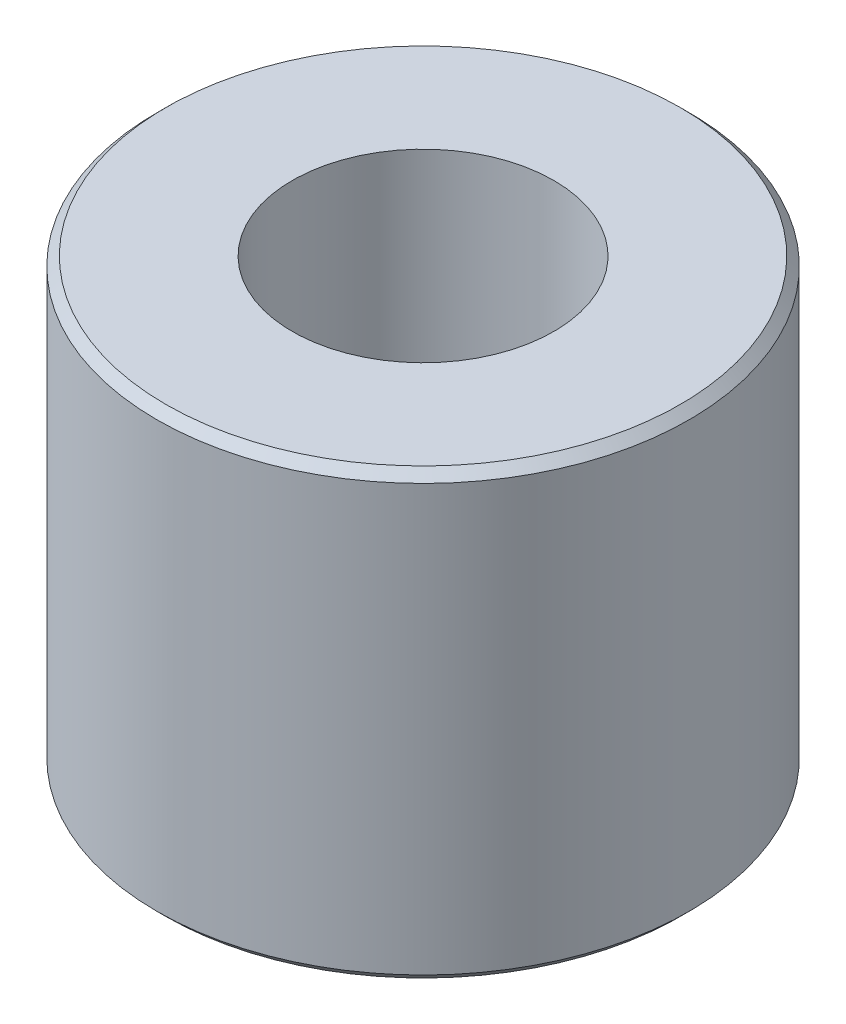
ISO-10303-21;
HEADER;
FILE_DESCRIPTION(('STEP AP214'),'2;1');
FILE_NAME('part.step','',(''),(''),'','','');
FILE_SCHEMA(('AUTOMOTIVE_DESIGN { 1 0 10303 214 1 1 1 1 }'));
ENDSEC;
DATA;
#1=APPLICATION_CONTEXT('core data for automotive mechanical design processes');
#2=APPLICATION_PROTOCOL_DEFINITION('international standard','automotive_design',2000,#1);
#3=PRODUCT_CONTEXT('',#1,'mechanical');
#4=PRODUCT('Part','Part','',(#3));
#5=PRODUCT_RELATED_PRODUCT_CATEGORY('part','',(#4));
#6=PRODUCT_DEFINITION_FORMATION('','',#4);
#7=PRODUCT_DEFINITION_CONTEXT('part definition',#1,'design');
#8=PRODUCT_DEFINITION('design','',#6,#7);
#9=PRODUCT_DEFINITION_SHAPE('','',#8);
#10=(LENGTH_UNIT() NAMED_UNIT(*) SI_UNIT(.MILLI.,.METRE.));
#11=(NAMED_UNIT(*) PLANE_ANGLE_UNIT() SI_UNIT($,.RADIAN.));
#12=(NAMED_UNIT(*) SI_UNIT($,.STERADIAN.) SOLID_ANGLE_UNIT());
#13=UNCERTAINTY_MEASURE_WITH_UNIT(LENGTH_MEASURE(1.E-05),#10,'distance_accuracy_value','');
#14=(GEOMETRIC_REPRESENTATION_CONTEXT(3) GLOBAL_UNCERTAINTY_ASSIGNED_CONTEXT((#13)) GLOBAL_UNIT_ASSIGNED_CONTEXT((#10,
#11,#12)) REPRESENTATION_CONTEXT('',''));
#15=CARTESIAN_POINT('',(0.,0.,0.));
#16=DIRECTION('',(0.,0.,1.));
#17=DIRECTION('',(1.,0.,0.));
#18=AXIS2_PLACEMENT_3D('',#15,#16,#17);
#19=CARTESIAN_POINT('',(0.,57.7500232056,0.));
#20=DIRECTION('',(0.,-1.,0.));
#21=DIRECTION('',(0.,0.,-1.));
#22=AXIS2_PLACEMENT_3D('',#19,#20,#21);
#23=CYLINDRICAL_SURFACE('',#22,14.75);
#24=CARTESIAN_POINT('',(0.,50.,0.));
#25=DIRECTION('',(0.,-1.,0.));
#26=DIRECTION('',(0.,0.,-1.));
#27=AXIS2_PLACEMENT_3D('',#24,#25,#26);
#28=CIRCLE('',#27,14.75);
#29=CARTESIAN_POINT('',(0.,50.,-14.75));
#30=VERTEX_POINT('',#29);
#31=EDGE_CURVE('P0_E33',#30,#30,#28,.T.);
#32=ORIENTED_EDGE('',*,*,#31,.F.);
#33=EDGE_LOOP('',(#32));
#34=FACE_BOUND('',#33,.T.);
#35=CARTESIAN_POINT('',(0.,0.,0.));
#36=DIRECTION('',(0.,-1.,0.));
#37=DIRECTION('',(0.,0.,-1.));
#38=AXIS2_PLACEMENT_3D('',#35,#36,#37);
#39=CIRCLE('',#38,14.75);
#40=CARTESIAN_POINT('',(0.,0.,-14.75));
#41=VERTEX_POINT('',#40);
#42=EDGE_CURVE('P0_E17',#41,#41,#39,.T.);
#43=ORIENTED_EDGE('',*,*,#42,.T.);
#44=EDGE_LOOP('',(#43));
#45=FACE_BOUND('',#44,.T.);
#46=ADVANCED_FACE('P0_F14',(#34,#45),#23,.F.);
#47=CARTESIAN_POINT('',(0.,0.,0.));
#48=DIRECTION('',(0.,1.,0.));
#49=DIRECTION('',(0.,0.,1.));
#50=AXIS2_PLACEMENT_3D('',#47,#48,#49);
#51=PLANE('',#50);
#52=ORIENTED_EDGE('',*,*,#42,.F.);
#53=EDGE_LOOP('',(#52));
#54=FACE_BOUND('',#53,.T.);
#55=CARTESIAN_POINT('',(0.,0.,0.));
#56=DIRECTION('',(0.,1.,0.));
#57=DIRECTION('',(0.,0.,1.));
#58=AXIS2_PLACEMENT_3D('',#55,#56,#57);
#59=CIRCLE('',#58,28.9999947346989);
#60=CARTESIAN_POINT('',(0.,0.,28.999994734699));
#61=VERTEX_POINT('',#60);
#62=EDGE_CURVE('P0_E31',#61,#61,#59,.T.);
#63=ORIENTED_EDGE('',*,*,#62,.F.);
#64=EDGE_LOOP('',(#63));
#65=FACE_BOUND('',#64,.T.);
#66=ADVANCED_FACE('P0_F41',(#54,#65),#51,.F.);
#67=CARTESIAN_POINT('',(0.,50.,0.));
#68=DIRECTION('',(0.,1.,0.));
#69=DIRECTION('',(0.,0.,1.));
#70=AXIS2_PLACEMENT_3D('',#67,#68,#69);
#71=PLANE('',#70);
#72=ORIENTED_EDGE('',*,*,#31,.T.);
#73=EDGE_LOOP('',(#72));
#74=FACE_BOUND('',#73,.T.);
#75=CARTESIAN_POINT('',(0.,50.,0.));
#76=DIRECTION('',(0.,1.,0.));
#77=DIRECTION('',(0.,0.,1.));
#78=AXIS2_PLACEMENT_3D('',#75,#76,#77);
#79=CIRCLE('',#78,28.9999947347188);
#80=CARTESIAN_POINT('',(0.,50.,28.9999947347188));
#81=VERTEX_POINT('',#80);
#82=EDGE_CURVE('P0_E26',#81,#81,#79,.F.);
#83=ORIENTED_EDGE('',*,*,#82,.F.);
#84=EDGE_LOOP('',(#83));
#85=FACE_BOUND('',#84,.T.);
#86=ADVANCED_FACE('P0_F44',(#74,#85),#71,.T.);
#87=CARTESIAN_POINT('',(0.,1.00000272317718,0.));
#88=DIRECTION('',(0.,1.,0.));
#89=DIRECTION('',(0.,0.,1.));
#90=AXIS2_PLACEMENT_3D('',#87,#88,#89);
#91=CONICAL_SURFACE('',#90,29.9999972763128,0.785398072616002);
#92=CARTESIAN_POINT('',(0.,1.,0.));
#93=DIRECTION('',(0.,1.,0.));
#94=DIRECTION('',(0.,0.,1.));
#95=AXIS2_PLACEMENT_3D('',#92,#93,#94);
#96=CIRCLE('',#95,30.);
#97=CARTESIAN_POINT('',(0.,1.,30.0000000000001));
#98=VERTEX_POINT('',#97);
#99=EDGE_CURVE('P0_E21',#98,#98,#96,.T.);
#100=ORIENTED_EDGE('',*,*,#99,.F.);
#101=EDGE_LOOP('',(#100));
#102=FACE_BOUND('',#101,.T.);
#103=ORIENTED_EDGE('',*,*,#62,.T.);
#104=EDGE_LOOP('',(#103));
#105=FACE_BOUND('',#104,.T.);
#106=ADVANCED_FACE('P0_F47',(#102,#105),#91,.T.);
#107=CARTESIAN_POINT('',(0.,48.9999972765779,0.));
#108=DIRECTION('',(0.,-1.,0.));
#109=DIRECTION('',(0.,0.,-1.));
#110=AXIS2_PLACEMENT_3D('',#107,#108,#109);
#111=CONICAL_SURFACE('',#110,29.9999972765774,0.785398072616);
#112=CARTESIAN_POINT('',(0.,49.,0.));
#113=DIRECTION('',(0.,1.,0.));
#114=DIRECTION('',(0.,0.,1.));
#115=AXIS2_PLACEMENT_3D('',#112,#113,#114);
#116=CIRCLE('',#115,30.);
#117=CARTESIAN_POINT('',(0.,49.,30.0000000000001));
#118=VERTEX_POINT('',#117);
#119=EDGE_CURVE('P0_E10',#118,#118,#116,.F.);
#120=ORIENTED_EDGE('',*,*,#119,.F.);
#121=EDGE_LOOP('',(#120));
#122=FACE_BOUND('',#121,.T.);
#123=ORIENTED_EDGE('',*,*,#82,.T.);
#124=EDGE_LOOP('',(#123));
#125=FACE_BOUND('',#124,.T.);
#126=ADVANCED_FACE('P0_F49',(#122,#125),#111,.T.);
#127=CARTESIAN_POINT('',(0.,0.,0.));
#128=DIRECTION('',(0.,1.,0.));
#129=DIRECTION('',(0.,0.,1.));
#130=AXIS2_PLACEMENT_3D('',#127,#128,#129);
#131=CYLINDRICAL_SURFACE('',#130,30.);
#132=ORIENTED_EDGE('',*,*,#99,.T.);
#133=EDGE_LOOP('',(#132));
#134=FACE_BOUND('',#133,.T.);
#135=ORIENTED_EDGE('',*,*,#119,.T.);
#136=EDGE_LOOP('',(#135));
#137=FACE_BOUND('',#136,.T.);
#138=ADVANCED_FACE('P0_F57',(#134,#137),#131,.T.);
#139=CLOSED_SHELL('',(#46,#66,#86,#106,#126,#138));
#140=MANIFOLD_SOLID_BREP('P0_B1',#139);
#141=CARTESIAN_POINT('',(0.,57.7500232056,0.));
#142=DIRECTION('',(0.,-1.,0.));
#143=DIRECTION('',(0.,0.,-1.));
#144=AXIS2_PLACEMENT_3D('',#141,#142,#143);
#145=CYLINDRICAL_SURFACE('',#144,16.5);
#146=CARTESIAN_POINT('',(0.,50.,0.));
#147=DIRECTION('',(0.,-1.,0.));
#148=DIRECTION('',(0.,0.,-1.));
#149=AXIS2_PLACEMENT_3D('',#146,#147,#148);
#150=CIRCLE('',#149,16.5);
#151=CARTESIAN_POINT('',(0.,50.,-16.5));
#152=VERTEX_POINT('',#151);
#153=EDGE_CURVE('P1_E10',#152,#152,#150,.T.);
#154=ORIENTED_EDGE('',*,*,#153,.T.);
#155=EDGE_LOOP('',(#154));
#156=FACE_BOUND('',#155,.T.);
#157=CARTESIAN_POINT('',(0.,0.,0.));
#158=DIRECTION('',(0.,-1.,0.));
#159=DIRECTION('',(0.,0.,-1.));
#160=AXIS2_PLACEMENT_3D('',#157,#158,#159);
#161=CIRCLE('',#160,16.5);
#162=CARTESIAN_POINT('',(0.,0.,-16.5));
#163=VERTEX_POINT('',#162);
#164=EDGE_CURVE('P1_E15',#163,#163,#161,.F.);
#165=ORIENTED_EDGE('',*,*,#164,.T.);
#166=EDGE_LOOP('',(#165));
#167=FACE_BOUND('',#166,.T.);
#168=ADVANCED_FACE('P1_F14',(#156,#167),#145,.T.);
#169=OPEN_SHELL('',(#168));
#170=SHELL_BASED_SURFACE_MODEL('P1_B1',(#169));
#171=ADVANCED_BREP_SHAPE_REPRESENTATION('',(#18,#140),#14);
#172=MANIFOLD_SURFACE_SHAPE_REPRESENTATION('',(#18,#170),#14);
#173=SHAPE_REPRESENTATION('',(#18),#14);
#174=SHAPE_DEFINITION_REPRESENTATION(#9,#173);
#175=SHAPE_REPRESENTATION_RELATIONSHIP('','',#173,#171);
#176=SHAPE_REPRESENTATION_RELATIONSHIP('','',#173,#172);
ENDSEC;
END-ISO-10303-21;
